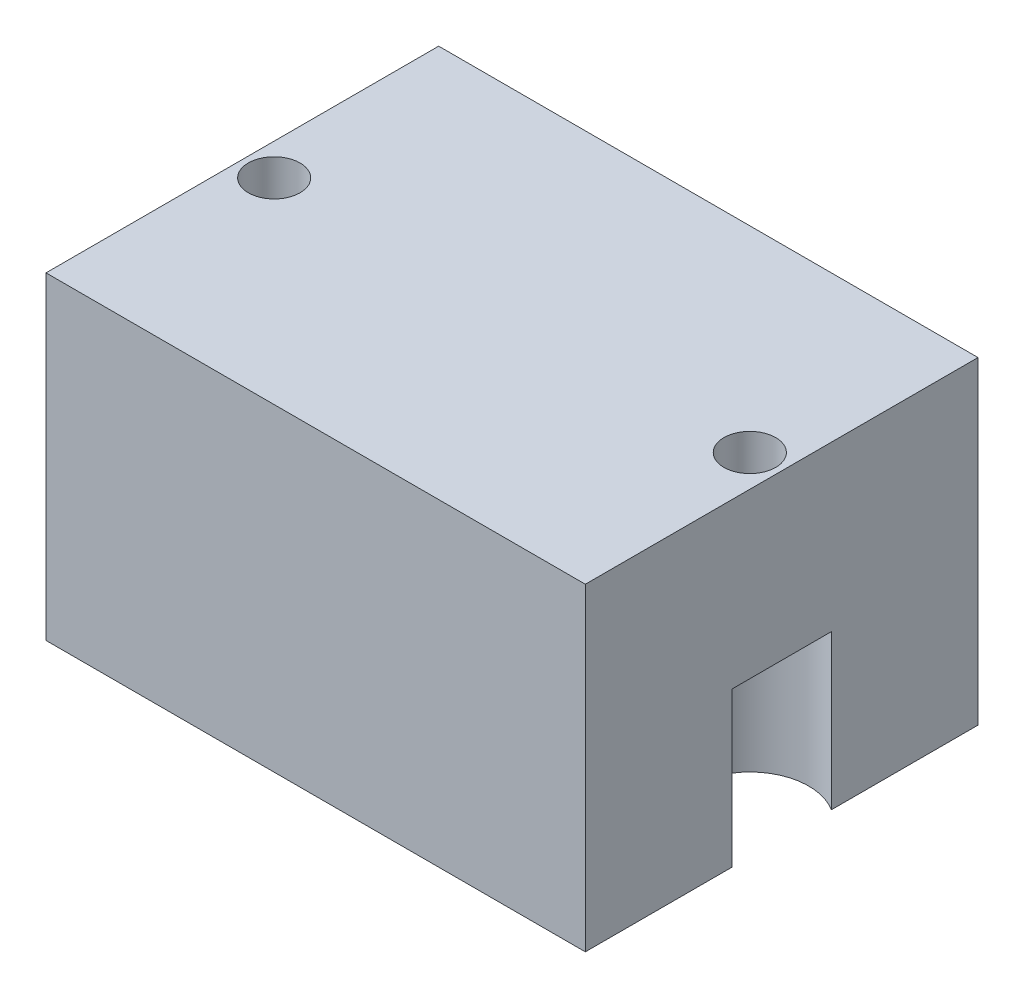
ISO-10303-21;
HEADER;
FILE_DESCRIPTION(('STEP AP214'),'2;1');
FILE_NAME('part.step','',(''),(''),'','','');
FILE_SCHEMA(('AUTOMOTIVE_DESIGN { 1 0 10303 214 1 1 1 1 }'));
ENDSEC;
DATA;
#1=APPLICATION_CONTEXT('core data for automotive mechanical design processes');
#2=APPLICATION_PROTOCOL_DEFINITION('international standard','automotive_design',2000,#1);
#3=PRODUCT_CONTEXT('',#1,'mechanical');
#4=PRODUCT('Part','Part','',(#3));
#5=PRODUCT_RELATED_PRODUCT_CATEGORY('part','',(#4));
#6=PRODUCT_DEFINITION_FORMATION('','',#4);
#7=PRODUCT_DEFINITION_CONTEXT('part definition',#1,'design');
#8=PRODUCT_DEFINITION('design','',#6,#7);
#9=PRODUCT_DEFINITION_SHAPE('','',#8);
#10=(LENGTH_UNIT() NAMED_UNIT(*) SI_UNIT(.MILLI.,.METRE.));
#11=(NAMED_UNIT(*) PLANE_ANGLE_UNIT() SI_UNIT($,.RADIAN.));
#12=(NAMED_UNIT(*) SI_UNIT($,.STERADIAN.) SOLID_ANGLE_UNIT());
#13=UNCERTAINTY_MEASURE_WITH_UNIT(LENGTH_MEASURE(1.E-05),#10,'distance_accuracy_value','');
#14=(GEOMETRIC_REPRESENTATION_CONTEXT(3) GLOBAL_UNCERTAINTY_ASSIGNED_CONTEXT((#13)) GLOBAL_UNIT_ASSIGNED_CONTEXT((#10,
#11,#12)) REPRESENTATION_CONTEXT('',''));
#15=CARTESIAN_POINT('',(0.,0.,0.));
#16=DIRECTION('',(0.,0.,1.));
#17=DIRECTION('',(1.,0.,0.));
#18=AXIS2_PLACEMENT_3D('',#15,#16,#17);
#19=CARTESIAN_POINT('',(0.,15.,0.));
#20=DIRECTION('',(1.,0.,0.));
#21=DIRECTION('',(0.,0.,-1.));
#22=AXIS2_PLACEMENT_3D('',#19,#20,#21);
#23=PLANE('',#22);
#24=DIRECTION('',(0.,0.,1.));
#25=VECTOR('',#24,1.);
#26=CARTESIAN_POINT('',(0.,7.269988,0.));
#27=LINE('',#26,#25);
#28=CARTESIAN_POINT('',(0.,7.269988,-11.5891252932667));
#29=VERTEX_POINT('',#28);
#30=CARTESIAN_POINT('',(0.,7.269988,-6.91087470673331));
#31=VERTEX_POINT('',#30);
#32=EDGE_CURVE('E132',#29,#31,#27,.T.);
#33=ORIENTED_EDGE('',*,*,#32,.T.);
#34=DIRECTION('',(0.,-1.,0.));
#35=VECTOR('',#34,1.);
#36=CARTESIAN_POINT('',(0.,0.,-6.91087470673331));
#37=LINE('',#36,#35);
#38=CARTESIAN_POINT('',(0.,0.,-6.91087470673331));
#39=VERTEX_POINT('',#38);
#40=EDGE_CURVE('E182',#31,#39,#37,.T.);
#41=ORIENTED_EDGE('',*,*,#40,.T.);
#42=DIRECTION('',(0.,0.,1.));
#43=VECTOR('',#42,1.);
#44=CARTESIAN_POINT('',(0.,0.,0.));
#45=LINE('',#44,#43);
#46=CARTESIAN_POINT('',(0.,0.,0.));
#47=VERTEX_POINT('',#46);
#48=EDGE_CURVE('E245',#39,#47,#45,.T.);
#49=ORIENTED_EDGE('',*,*,#48,.T.);
#50=DIRECTION('',(0.,-1.,0.));
#51=VECTOR('',#50,1.);
#52=CARTESIAN_POINT('',(0.,15.,0.));
#53=LINE('',#52,#51);
#54=CARTESIAN_POINT('',(0.,15.,0.));
#55=VERTEX_POINT('',#54);
#56=EDGE_CURVE('E172',#55,#47,#53,.T.);
#57=ORIENTED_EDGE('',*,*,#56,.F.);
#58=DIRECTION('',(0.,0.,1.));
#59=VECTOR('',#58,1.);
#60=CARTESIAN_POINT('',(0.,15.,0.));
#61=LINE('',#60,#59);
#62=CARTESIAN_POINT('',(0.,15.,-18.5));
#63=VERTEX_POINT('',#62);
#64=EDGE_CURVE('E159',#63,#55,#61,.T.);
#65=ORIENTED_EDGE('',*,*,#64,.F.);
#66=DIRECTION('',(0.,-1.,0.));
#67=VECTOR('',#66,1.);
#68=CARTESIAN_POINT('',(0.,15.,-18.5));
#69=LINE('',#68,#67);
#70=CARTESIAN_POINT('',(0.,0.,-18.5));
#71=VERTEX_POINT('',#70);
#72=EDGE_CURVE('E160',#63,#71,#69,.T.);
#73=ORIENTED_EDGE('',*,*,#72,.T.);
#74=CARTESIAN_POINT('',(0.,0.,-11.5891252932667));
#75=VERTEX_POINT('',#74);
#76=EDGE_CURVE('E153',#71,#75,#45,.T.);
#77=ORIENTED_EDGE('',*,*,#76,.T.);
#78=DIRECTION('',(0.,-1.,0.));
#79=VECTOR('',#78,1.);
#80=CARTESIAN_POINT('',(0.,0.,-11.5891252932667));
#81=LINE('',#80,#79);
#82=EDGE_CURVE('E70',#75,#29,#81,.F.);
#83=ORIENTED_EDGE('',*,*,#82,.T.);
#84=EDGE_LOOP('',(#33,#41,#49,#57,#65,#73,#77,#83));
#85=FACE_BOUND('',#84,.T.);
#86=ADVANCED_FACE('F47',(#85),#23,.F.);
#87=CARTESIAN_POINT('',(0.,15.,0.));
#88=DIRECTION('',(0.,0.,-1.));
#89=DIRECTION('',(-1.,0.,0.));
#90=AXIS2_PLACEMENT_3D('',#87,#88,#89);
#91=PLANE('',#90);
#92=DIRECTION('',(1.,0.,0.));
#93=VECTOR('',#92,1.);
#94=CARTESIAN_POINT('',(0.,0.,0.));
#95=LINE('',#94,#93);
#96=CARTESIAN_POINT('',(25.41,0.,0.));
#97=VERTEX_POINT('',#96);
#98=EDGE_CURVE('E149',#47,#97,#95,.T.);
#99=ORIENTED_EDGE('',*,*,#98,.T.);
#100=DIRECTION('',(0.,-1.,0.));
#101=VECTOR('',#100,1.);
#102=CARTESIAN_POINT('',(25.41,15.,0.));
#103=LINE('',#102,#101);
#104=CARTESIAN_POINT('',(25.41,15.,0.));
#105=VERTEX_POINT('',#104);
#106=EDGE_CURVE('E168',#105,#97,#103,.T.);
#107=ORIENTED_EDGE('',*,*,#106,.F.);
#108=DIRECTION('',(1.,0.,0.));
#109=VECTOR('',#108,1.);
#110=CARTESIAN_POINT('',(0.,15.,0.));
#111=LINE('',#110,#109);
#112=EDGE_CURVE('E249',#55,#105,#111,.T.);
#113=ORIENTED_EDGE('',*,*,#112,.F.);
#114=ORIENTED_EDGE('',*,*,#56,.T.);
#115=EDGE_LOOP('',(#99,#107,#113,#114));
#116=FACE_BOUND('',#115,.T.);
#117=ADVANCED_FACE('F263',(#116),#91,.F.);
#118=CARTESIAN_POINT('',(25.41,15.,0.));
#119=DIRECTION('',(-1.,0.,0.));
#120=DIRECTION('',(0.,0.,1.));
#121=AXIS2_PLACEMENT_3D('',#118,#119,#120);
#122=PLANE('',#121);
#123=DIRECTION('',(0.,0.,-1.));
#124=VECTOR('',#123,1.);
#125=CARTESIAN_POINT('',(25.41,7.269988,0.));
#126=LINE('',#125,#124);
#127=CARTESIAN_POINT('',(25.41,7.269988,-6.91087470673331));
#128=VERTEX_POINT('',#127);
#129=CARTESIAN_POINT('',(25.41,7.269988,-11.5891252932667));
#130=VERTEX_POINT('',#129);
#131=EDGE_CURVE('E11',#128,#130,#126,.T.);
#132=ORIENTED_EDGE('',*,*,#131,.T.);
#133=DIRECTION('',(0.,-1.,0.));
#134=VECTOR('',#133,1.);
#135=CARTESIAN_POINT('',(25.41,0.,-11.5891252932667));
#136=LINE('',#135,#134);
#137=CARTESIAN_POINT('',(25.41,0.,-11.5891252932667));
#138=VERTEX_POINT('',#137);
#139=EDGE_CURVE('E125',#130,#138,#136,.T.);
#140=ORIENTED_EDGE('',*,*,#139,.T.);
#141=DIRECTION('',(0.,0.,-1.));
#142=VECTOR('',#141,1.);
#143=CARTESIAN_POINT('',(25.41,0.,0.));
#144=LINE('',#143,#142);
#145=CARTESIAN_POINT('',(25.41,0.,-18.5));
#146=VERTEX_POINT('',#145);
#147=EDGE_CURVE('E137',#138,#146,#144,.T.);
#148=ORIENTED_EDGE('',*,*,#147,.T.);
#149=DIRECTION('',(0.,-1.,0.));
#150=VECTOR('',#149,1.);
#151=CARTESIAN_POINT('',(25.41,15.,-18.5));
#152=LINE('',#151,#150);
#153=CARTESIAN_POINT('',(25.41,15.,-18.5));
#154=VERTEX_POINT('',#153);
#155=EDGE_CURVE('E164',#154,#146,#152,.T.);
#156=ORIENTED_EDGE('',*,*,#155,.F.);
#157=DIRECTION('',(0.,0.,-1.));
#158=VECTOR('',#157,1.);
#159=CARTESIAN_POINT('',(25.41,15.,0.));
#160=LINE('',#159,#158);
#161=EDGE_CURVE('E252',#105,#154,#160,.T.);
#162=ORIENTED_EDGE('',*,*,#161,.F.);
#163=ORIENTED_EDGE('',*,*,#106,.T.);
#164=CARTESIAN_POINT('',(25.41,0.,-6.91087470673331));
#165=VERTEX_POINT('',#164);
#166=EDGE_CURVE('E148',#97,#165,#144,.T.);
#167=ORIENTED_EDGE('',*,*,#166,.T.);
#168=DIRECTION('',(0.,-1.,0.));
#169=VECTOR('',#168,1.);
#170=CARTESIAN_POINT('',(25.41,0.,-6.91087470673331));
#171=LINE('',#170,#169);
#172=EDGE_CURVE('E62',#165,#128,#171,.F.);
#173=ORIENTED_EDGE('',*,*,#172,.T.);
#174=EDGE_LOOP('',(#132,#140,#148,#156,#162,#163,#167,#173));
#175=FACE_BOUND('',#174,.T.);
#176=ADVANCED_FACE('F135',(#175),#122,.F.);
#177=CARTESIAN_POINT('',(0.,15.,-18.5));
#178=DIRECTION('',(0.,0.,1.));
#179=DIRECTION('',(1.,0.,0.));
#180=AXIS2_PLACEMENT_3D('',#177,#178,#179);
#181=PLANE('',#180);
#182=DIRECTION('',(-1.,0.,0.));
#183=VECTOR('',#182,1.);
#184=CARTESIAN_POINT('',(0.,0.,-18.5));
#185=LINE('',#184,#183);
#186=EDGE_CURVE('E146',#146,#71,#185,.T.);
#187=ORIENTED_EDGE('',*,*,#186,.T.);
#188=ORIENTED_EDGE('',*,*,#72,.F.);
#189=DIRECTION('',(-1.,0.,0.));
#190=VECTOR('',#189,1.);
#191=CARTESIAN_POINT('',(0.,15.,-18.5));
#192=LINE('',#191,#190);
#193=EDGE_CURVE('E165',#154,#63,#192,.T.);
#194=ORIENTED_EDGE('',*,*,#193,.F.);
#195=ORIENTED_EDGE('',*,*,#155,.T.);
#196=EDGE_LOOP('',(#187,#188,#194,#195));
#197=FACE_BOUND('',#196,.T.);
#198=ADVANCED_FACE('F270',(#197),#181,.F.);
#199=CARTESIAN_POINT('',(0.,15.,0.));
#200=DIRECTION('',(0.,-1.,0.));
#201=DIRECTION('',(0.,0.,-1.));
#202=AXIS2_PLACEMENT_3D('',#199,#200,#201);
#203=PLANE('',#202);
#204=CARTESIAN_POINT('',(23.91,15.,-9.25));
#205=DIRECTION('',(0.,-1.,0.));
#206=DIRECTION('',(0.,0.,-1.));
#207=AXIS2_PLACEMENT_3D('',#204,#205,#206);
#208=CIRCLE('',#207,1.2192);
#209=CARTESIAN_POINT('',(23.91,15.,-10.4692));
#210=VERTEX_POINT('',#209);
#211=EDGE_CURVE('E272',#210,#210,#208,.T.);
#212=ORIENTED_EDGE('',*,*,#211,.T.);
#213=EDGE_LOOP('',(#212));
#214=FACE_BOUND('',#213,.T.);
#215=CARTESIAN_POINT('',(1.5,15.,-9.25));
#216=DIRECTION('',(0.,-1.,0.));
#217=DIRECTION('',(0.,0.,-1.));
#218=AXIS2_PLACEMENT_3D('',#215,#216,#217);
#219=CIRCLE('',#218,1.2192);
#220=CARTESIAN_POINT('',(1.5,15.,-10.4692));
#221=VERTEX_POINT('',#220);
#222=EDGE_CURVE('E194',#221,#221,#219,.T.);
#223=ORIENTED_EDGE('',*,*,#222,.T.);
#224=EDGE_LOOP('',(#223));
#225=FACE_BOUND('',#224,.T.);
#226=ORIENTED_EDGE('',*,*,#64,.T.);
#227=ORIENTED_EDGE('',*,*,#112,.T.);
#228=ORIENTED_EDGE('',*,*,#161,.T.);
#229=ORIENTED_EDGE('',*,*,#193,.T.);
#230=EDGE_LOOP('',(#226,#227,#228,#229));
#231=FACE_BOUND('',#230,.T.);
#232=ADVANCED_FACE('F266',(#214,#225,#231),#203,.F.);
#233=CARTESIAN_POINT('',(0.,0.,0.));
#234=DIRECTION('',(0.,-1.,0.));
#235=DIRECTION('',(0.,0.,-1.));
#236=AXIS2_PLACEMENT_3D('',#233,#234,#235);
#237=PLANE('',#236);
#238=CARTESIAN_POINT('',(23.91,0.,-9.25));
#239=DIRECTION('',(0.,-1.,0.));
#240=DIRECTION('',(0.,0.,-1.));
#241=AXIS2_PLACEMENT_3D('',#238,#239,#240);
#242=CIRCLE('',#241,2.77875999999999);
#243=EDGE_CURVE('E55',#165,#138,#242,.T.);
#244=ORIENTED_EDGE('',*,*,#243,.F.);
#245=ORIENTED_EDGE('',*,*,#166,.F.);
#246=ORIENTED_EDGE('',*,*,#98,.F.);
#247=ORIENTED_EDGE('',*,*,#48,.F.);
#248=CARTESIAN_POINT('',(1.5,0.,-9.25));
#249=DIRECTION('',(0.,-1.,0.));
#250=DIRECTION('',(0.,0.,-1.));
#251=AXIS2_PLACEMENT_3D('',#248,#249,#250);
#252=CIRCLE('',#251,2.77875999999999);
#253=EDGE_CURVE('E176',#75,#39,#252,.T.);
#254=ORIENTED_EDGE('',*,*,#253,.F.);
#255=ORIENTED_EDGE('',*,*,#76,.F.);
#256=ORIENTED_EDGE('',*,*,#186,.F.);
#257=ORIENTED_EDGE('',*,*,#147,.F.);
#258=EDGE_LOOP('',(#244,#245,#246,#247,#254,#255,#256,#257));
#259=FACE_BOUND('',#258,.T.);
#260=CARTESIAN_POINT('',(12.705,0.,-9.25));
#261=DIRECTION('',(0.,-1.,0.));
#262=DIRECTION('',(0.,0.,-1.));
#263=AXIS2_PLACEMENT_3D('',#260,#261,#262);
#264=CIRCLE('',#263,3.);
#265=CARTESIAN_POINT('',(12.705,0.,-12.25));
#266=VERTEX_POINT('',#265);
#267=EDGE_CURVE('E205',#266,#266,#264,.T.);
#268=ORIENTED_EDGE('',*,*,#267,.F.);
#269=EDGE_LOOP('',(#268));
#270=FACE_BOUND('',#269,.T.);
#271=CARTESIAN_POINT('',(23.91,0.,-17.));
#272=DIRECTION('',(0.,-1.,0.));
#273=DIRECTION('',(0.,0.,-1.));
#274=AXIS2_PLACEMENT_3D('',#271,#272,#273);
#275=CIRCLE('',#274,0.88899999999999);
#276=CARTESIAN_POINT('',(23.91,0.,-17.889));
#277=VERTEX_POINT('',#276);
#278=EDGE_CURVE('E210',#277,#277,#275,.T.);
#279=ORIENTED_EDGE('',*,*,#278,.F.);
#280=EDGE_LOOP('',(#279));
#281=FACE_BOUND('',#280,.T.);
#282=CARTESIAN_POINT('',(23.91,0.,-1.5));
#283=DIRECTION('',(0.,-1.,0.));
#284=DIRECTION('',(0.,0.,-1.));
#285=AXIS2_PLACEMENT_3D('',#282,#283,#284);
#286=CIRCLE('',#285,0.88899999999999);
#287=CARTESIAN_POINT('',(23.91,0.,-2.38899999999999));
#288=VERTEX_POINT('',#287);
#289=EDGE_CURVE('E221',#288,#288,#286,.T.);
#290=ORIENTED_EDGE('',*,*,#289,.F.);
#291=EDGE_LOOP('',(#290));
#292=FACE_BOUND('',#291,.T.);
#293=CARTESIAN_POINT('',(1.5,0.,-1.5));
#294=DIRECTION('',(0.,-1.,0.));
#295=DIRECTION('',(0.,0.,-1.));
#296=AXIS2_PLACEMENT_3D('',#293,#294,#295);
#297=CIRCLE('',#296,0.888999999999989);
#298=CARTESIAN_POINT('',(1.5,0.,-2.38899999999999));
#299=VERTEX_POINT('',#298);
#300=EDGE_CURVE('E229',#299,#299,#297,.T.);
#301=ORIENTED_EDGE('',*,*,#300,.F.);
#302=EDGE_LOOP('',(#301));
#303=FACE_BOUND('',#302,.T.);
#304=CARTESIAN_POINT('',(1.5,0.,-17.));
#305=DIRECTION('',(0.,-1.,0.));
#306=DIRECTION('',(0.,0.,-1.));
#307=AXIS2_PLACEMENT_3D('',#304,#305,#306);
#308=CIRCLE('',#307,0.888999999999989);
#309=CARTESIAN_POINT('',(1.5,0.,-17.889));
#310=VERTEX_POINT('',#309);
#311=EDGE_CURVE('E237',#310,#310,#308,.T.);
#312=ORIENTED_EDGE('',*,*,#311,.F.);
#313=EDGE_LOOP('',(#312));
#314=FACE_BOUND('',#313,.T.);
#315=ADVANCED_FACE('F143',(#259,#270,#281,#292,#303,#314),#237,.T.);
#316=CARTESIAN_POINT('',(1.5,7.4658349096845,-17.));
#317=DIRECTION('',(0.,-1.,0.));
#318=DIRECTION('',(0.,0.,-1.));
#319=AXIS2_PLACEMENT_3D('',#316,#317,#318);
#320=CONICAL_SURFACE('',#319,0.888999999999999,1.02974425867665);
#321=CARTESIAN_POINT('',(1.5,8.,-17.));
#322=VERTEX_POINT('',#321);
#323=VERTEX_LOOP('',#322);
#324=FACE_BOUND('',#323,.T.);
#325=CARTESIAN_POINT('',(1.5,7.4658349096845,-17.));
#326=DIRECTION('',(0.,-1.,0.));
#327=DIRECTION('',(0.,0.,-1.));
#328=AXIS2_PLACEMENT_3D('',#325,#326,#327);
#329=CIRCLE('',#328,0.888999999999999);
#330=CARTESIAN_POINT('',(1.5,7.4658349096845,-17.889));
#331=VERTEX_POINT('',#330);
#332=EDGE_CURVE('E241',#331,#331,#329,.T.);
#333=ORIENTED_EDGE('',*,*,#332,.T.);
#334=EDGE_LOOP('',(#333));
#335=FACE_BOUND('',#334,.T.);
#336=ADVANCED_FACE('F312',(#324,#335),#320,.F.);
#337=CARTESIAN_POINT('',(1.5,0.,-17.));
#338=DIRECTION('',(0.,-1.,0.));
#339=DIRECTION('',(0.,0.,-1.));
#340=AXIS2_PLACEMENT_3D('',#337,#338,#339);
#341=CYLINDRICAL_SURFACE('',#340,0.888999999999994);
#342=ORIENTED_EDGE('',*,*,#332,.F.);
#343=EDGE_LOOP('',(#342));
#344=FACE_BOUND('',#343,.T.);
#345=ORIENTED_EDGE('',*,*,#311,.T.);
#346=EDGE_LOOP('',(#345));
#347=FACE_BOUND('',#346,.T.);
#348=ADVANCED_FACE('F318',(#344,#347),#341,.F.);
#349=CARTESIAN_POINT('',(1.5,7.4658349096845,-1.5));
#350=DIRECTION('',(0.,-1.,0.));
#351=DIRECTION('',(0.,0.,-1.));
#352=AXIS2_PLACEMENT_3D('',#349,#350,#351);
#353=CONICAL_SURFACE('',#352,0.888999999999998,1.02974425867665);
#354=CARTESIAN_POINT('',(1.5,8.,-1.5));
#355=VERTEX_POINT('',#354);
#356=VERTEX_LOOP('',#355);
#357=FACE_BOUND('',#356,.T.);
#358=CARTESIAN_POINT('',(1.5,7.4658349096845,-1.5));
#359=DIRECTION('',(0.,-1.,0.));
#360=DIRECTION('',(0.,0.,-1.));
#361=AXIS2_PLACEMENT_3D('',#358,#359,#360);
#362=CIRCLE('',#361,0.888999999999998);
#363=CARTESIAN_POINT('',(1.5,7.4658349096845,-2.389));
#364=VERTEX_POINT('',#363);
#365=EDGE_CURVE('E233',#364,#364,#362,.T.);
#366=ORIENTED_EDGE('',*,*,#365,.T.);
#367=EDGE_LOOP('',(#366));
#368=FACE_BOUND('',#367,.T.);
#369=ADVANCED_FACE('F322',(#357,#368),#353,.F.);
#370=CARTESIAN_POINT('',(1.5,0.,-1.5));
#371=DIRECTION('',(0.,-1.,0.));
#372=DIRECTION('',(0.,0.,-1.));
#373=AXIS2_PLACEMENT_3D('',#370,#371,#372);
#374=CYLINDRICAL_SURFACE('',#373,0.888999999999994);
#375=ORIENTED_EDGE('',*,*,#365,.F.);
#376=EDGE_LOOP('',(#375));
#377=FACE_BOUND('',#376,.T.);
#378=ORIENTED_EDGE('',*,*,#300,.T.);
#379=EDGE_LOOP('',(#378));
#380=FACE_BOUND('',#379,.T.);
#381=ADVANCED_FACE('F326',(#377,#380),#374,.F.);
#382=CARTESIAN_POINT('',(23.91,7.4658349096845,-1.5));
#383=DIRECTION('',(0.,-1.,0.));
#384=DIRECTION('',(0.,0.,-1.));
#385=AXIS2_PLACEMENT_3D('',#382,#383,#384);
#386=CONICAL_SURFACE('',#385,0.888999999999997,1.02974425867665);
#387=CARTESIAN_POINT('',(23.91,8.,-1.5));
#388=VERTEX_POINT('',#387);
#389=VERTEX_LOOP('',#388);
#390=FACE_BOUND('',#389,.T.);
#391=CARTESIAN_POINT('',(23.91,7.4658349096845,-1.5));
#392=DIRECTION('',(0.,-1.,0.));
#393=DIRECTION('',(0.,0.,-1.));
#394=AXIS2_PLACEMENT_3D('',#391,#392,#393);
#395=CIRCLE('',#394,0.888999999999997);
#396=CARTESIAN_POINT('',(23.91,7.4658349096845,-2.389));
#397=VERTEX_POINT('',#396);
#398=EDGE_CURVE('E225',#397,#397,#395,.T.);
#399=ORIENTED_EDGE('',*,*,#398,.T.);
#400=EDGE_LOOP('',(#399));
#401=FACE_BOUND('',#400,.T.);
#402=ADVANCED_FACE('F330',(#390,#401),#386,.F.);
#403=CARTESIAN_POINT('',(23.91,0.,-1.5));
#404=DIRECTION('',(0.,-1.,0.));
#405=DIRECTION('',(0.,0.,-1.));
#406=AXIS2_PLACEMENT_3D('',#403,#404,#405);
#407=CYLINDRICAL_SURFACE('',#406,0.888999999999994);
#408=ORIENTED_EDGE('',*,*,#398,.F.);
#409=EDGE_LOOP('',(#408));
#410=FACE_BOUND('',#409,.T.);
#411=ORIENTED_EDGE('',*,*,#289,.T.);
#412=EDGE_LOOP('',(#411));
#413=FACE_BOUND('',#412,.T.);
#414=ADVANCED_FACE('F334',(#410,#413),#407,.F.);
#415=CARTESIAN_POINT('',(23.91,7.4658349096845,-17.));
#416=DIRECTION('',(0.,-1.,0.));
#417=DIRECTION('',(0.,0.,-1.));
#418=AXIS2_PLACEMENT_3D('',#415,#416,#417);
#419=CONICAL_SURFACE('',#418,0.888999999999997,1.02974425867665);
#420=CARTESIAN_POINT('',(23.91,8.,-17.));
#421=VERTEX_POINT('',#420);
#422=VERTEX_LOOP('',#421);
#423=FACE_BOUND('',#422,.T.);
#424=CARTESIAN_POINT('',(23.91,7.4658349096845,-17.));
#425=DIRECTION('',(0.,-1.,0.));
#426=DIRECTION('',(0.,0.,-1.));
#427=AXIS2_PLACEMENT_3D('',#424,#425,#426);
#428=CIRCLE('',#427,0.888999999999997);
#429=CARTESIAN_POINT('',(23.91,7.4658349096845,-17.889));
#430=VERTEX_POINT('',#429);
#431=EDGE_CURVE('E217',#430,#430,#428,.T.);
#432=ORIENTED_EDGE('',*,*,#431,.T.);
#433=EDGE_LOOP('',(#432));
#434=FACE_BOUND('',#433,.T.);
#435=ADVANCED_FACE('F338',(#423,#434),#419,.F.);
#436=CARTESIAN_POINT('',(23.91,0.,-17.));
#437=DIRECTION('',(0.,-1.,0.));
#438=DIRECTION('',(0.,0.,-1.));
#439=AXIS2_PLACEMENT_3D('',#436,#437,#438);
#440=CYLINDRICAL_SURFACE('',#439,0.888999999999994);
#441=ORIENTED_EDGE('',*,*,#431,.F.);
#442=EDGE_LOOP('',(#441));
#443=FACE_BOUND('',#442,.T.);
#444=ORIENTED_EDGE('',*,*,#278,.T.);
#445=EDGE_LOOP('',(#444));
#446=FACE_BOUND('',#445,.T.);
#447=ADVANCED_FACE('F342',(#443,#446),#440,.F.);
#448=CARTESIAN_POINT('',(12.705,3.,-9.25));
#449=DIRECTION('',(0.,-1.,0.));
#450=DIRECTION('',(0.,0.,-1.));
#451=AXIS2_PLACEMENT_3D('',#448,#449,#450);
#452=CYLINDRICAL_SURFACE('',#451,3.);
#453=CARTESIAN_POINT('',(12.705,3.,-9.25));
#454=DIRECTION('',(0.,-1.,0.));
#455=DIRECTION('',(0.,0.,-1.));
#456=AXIS2_PLACEMENT_3D('',#453,#454,#455);
#457=CIRCLE('',#456,3.);
#458=CARTESIAN_POINT('',(12.705,3.,-12.25));
#459=VERTEX_POINT('',#458);
#460=EDGE_CURVE('E206',#459,#459,#457,.T.);
#461=ORIENTED_EDGE('',*,*,#460,.F.);
#462=EDGE_LOOP('',(#461));
#463=FACE_BOUND('',#462,.T.);
#464=ORIENTED_EDGE('',*,*,#267,.T.);
#465=EDGE_LOOP('',(#464));
#466=FACE_BOUND('',#465,.T.);
#467=ADVANCED_FACE('F346',(#463,#466),#452,.F.);
#468=CARTESIAN_POINT('',(12.705,3.,-9.25));
#469=DIRECTION('',(0.,-1.,0.));
#470=DIRECTION('',(0.,0.,-1.));
#471=AXIS2_PLACEMENT_3D('',#468,#469,#470);
#472=PLANE('',#471);
#473=ORIENTED_EDGE('',*,*,#460,.T.);
#474=EDGE_LOOP('',(#473));
#475=FACE_BOUND('',#474,.T.);
#476=ADVANCED_FACE('F350',(#475),#472,.T.);
#477=CARTESIAN_POINT('',(2.7192,7.269988,-9.25));
#478=DIRECTION('',(0.,1.,0.));
#479=DIRECTION('',(0.,0.,1.));
#480=AXIS2_PLACEMENT_3D('',#477,#478,#479);
#481=PLANE('',#480);
#482=CARTESIAN_POINT('',(1.5,7.269988,-9.25));
#483=DIRECTION('',(0.,-1.,0.));
#484=DIRECTION('',(0.,0.,-1.));
#485=AXIS2_PLACEMENT_3D('',#482,#483,#484);
#486=CIRCLE('',#485,1.2192);
#487=CARTESIAN_POINT('',(1.5,7.269988,-10.4692));
#488=VERTEX_POINT('',#487);
#489=EDGE_CURVE('E190',#488,#488,#486,.T.);
#490=ORIENTED_EDGE('',*,*,#489,.F.);
#491=EDGE_LOOP('',(#490));
#492=FACE_BOUND('',#491,.T.);
#493=CARTESIAN_POINT('',(1.5,7.269988,-9.25));
#494=DIRECTION('',(0.,-1.,0.));
#495=DIRECTION('',(0.,0.,-1.));
#496=AXIS2_PLACEMENT_3D('',#493,#494,#495);
#497=CIRCLE('',#496,2.77875999999999);
#498=EDGE_CURVE('E140',#29,#31,#497,.T.);
#499=ORIENTED_EDGE('',*,*,#498,.T.);
#500=ORIENTED_EDGE('',*,*,#32,.F.);
#501=EDGE_LOOP('',(#499,#500));
#502=FACE_BOUND('',#501,.T.);
#503=ADVANCED_FACE('F187',(#492,#502),#481,.F.);
#504=CARTESIAN_POINT('',(1.5,0.,-9.25));
#505=DIRECTION('',(0.,-1.,0.));
#506=DIRECTION('',(0.,0.,-1.));
#507=AXIS2_PLACEMENT_3D('',#504,#505,#506);
#508=CYLINDRICAL_SURFACE('',#507,2.77875999999999);
#509=ORIENTED_EDGE('',*,*,#498,.F.);
#510=ORIENTED_EDGE('',*,*,#82,.F.);
#511=ORIENTED_EDGE('',*,*,#253,.T.);
#512=ORIENTED_EDGE('',*,*,#40,.F.);
#513=EDGE_LOOP('',(#509,#510,#511,#512));
#514=FACE_BOUND('',#513,.T.);
#515=ADVANCED_FACE('F188',(#514),#508,.F.);
#516=CARTESIAN_POINT('',(1.5,0.,-9.25));
#517=DIRECTION('',(0.,-1.,0.));
#518=DIRECTION('',(0.,0.,-1.));
#519=AXIS2_PLACEMENT_3D('',#516,#517,#518);
#520=CYLINDRICAL_SURFACE('',#519,1.2192);
#521=ORIENTED_EDGE('',*,*,#222,.F.);
#522=EDGE_LOOP('',(#521));
#523=FACE_BOUND('',#522,.T.);
#524=ORIENTED_EDGE('',*,*,#489,.T.);
#525=EDGE_LOOP('',(#524));
#526=FACE_BOUND('',#525,.T.);
#527=ADVANCED_FACE('F286',(#523,#526),#520,.F.);
#528=CARTESIAN_POINT('',(25.1292,7.269988,-9.25));
#529=DIRECTION('',(0.,1.,0.));
#530=DIRECTION('',(0.,0.,1.));
#531=AXIS2_PLACEMENT_3D('',#528,#529,#530);
#532=PLANE('',#531);
#533=CARTESIAN_POINT('',(23.91,7.269988,-9.25));
#534=DIRECTION('',(0.,-1.,0.));
#535=DIRECTION('',(0.,0.,-1.));
#536=AXIS2_PLACEMENT_3D('',#533,#534,#535);
#537=CIRCLE('',#536,1.2192);
#538=CARTESIAN_POINT('',(23.91,7.269988,-10.4692));
#539=VERTEX_POINT('',#538);
#540=EDGE_CURVE('E275',#539,#539,#537,.T.);
#541=ORIENTED_EDGE('',*,*,#540,.F.);
#542=EDGE_LOOP('',(#541));
#543=FACE_BOUND('',#542,.T.);
#544=CARTESIAN_POINT('',(23.91,7.269988,-9.25));
#545=DIRECTION('',(0.,-1.,0.));
#546=DIRECTION('',(0.,0.,-1.));
#547=AXIS2_PLACEMENT_3D('',#544,#545,#546);
#548=CIRCLE('',#547,2.77875999999999);
#549=EDGE_CURVE('E281',#128,#130,#548,.T.);
#550=ORIENTED_EDGE('',*,*,#549,.T.);
#551=ORIENTED_EDGE('',*,*,#131,.F.);
#552=EDGE_LOOP('',(#550,#551));
#553=FACE_BOUND('',#552,.T.);
#554=ADVANCED_FACE('F284',(#543,#553),#532,.F.);
#555=CARTESIAN_POINT('',(23.91,0.,-9.25));
#556=DIRECTION('',(0.,-1.,0.));
#557=DIRECTION('',(0.,0.,-1.));
#558=AXIS2_PLACEMENT_3D('',#555,#556,#557);
#559=CYLINDRICAL_SURFACE('',#558,2.77875999999999);
#560=ORIENTED_EDGE('',*,*,#549,.F.);
#561=ORIENTED_EDGE('',*,*,#172,.F.);
#562=ORIENTED_EDGE('',*,*,#243,.T.);
#563=ORIENTED_EDGE('',*,*,#139,.F.);
#564=EDGE_LOOP('',(#560,#561,#562,#563));
#565=FACE_BOUND('',#564,.T.);
#566=ADVANCED_FACE('F124',(#565),#559,.F.);
#567=CARTESIAN_POINT('',(23.91,0.,-9.25));
#568=DIRECTION('',(0.,-1.,0.));
#569=DIRECTION('',(0.,0.,-1.));
#570=AXIS2_PLACEMENT_3D('',#567,#568,#569);
#571=CYLINDRICAL_SURFACE('',#570,1.2192);
#572=ORIENTED_EDGE('',*,*,#211,.F.);
#573=EDGE_LOOP('',(#572));
#574=FACE_BOUND('',#573,.T.);
#575=ORIENTED_EDGE('',*,*,#540,.T.);
#576=EDGE_LOOP('',(#575));
#577=FACE_BOUND('',#576,.T.);
#578=ADVANCED_FACE('F293',(#574,#577),#571,.F.);
#579=CLOSED_SHELL('',(#86,#117,#176,#198,#232,#315,#336,#348,#369,#381,#402,#414,#435,#447,#467,
#476,#503,#515,#527,#554,#566,#578));
#580=MANIFOLD_SOLID_BREP('B2',#579);
#581=ADVANCED_BREP_SHAPE_REPRESENTATION('',(#18,#580),#14);
#582=SHAPE_DEFINITION_REPRESENTATION(#9,#581);
ENDSEC;
END-ISO-10303-21;
